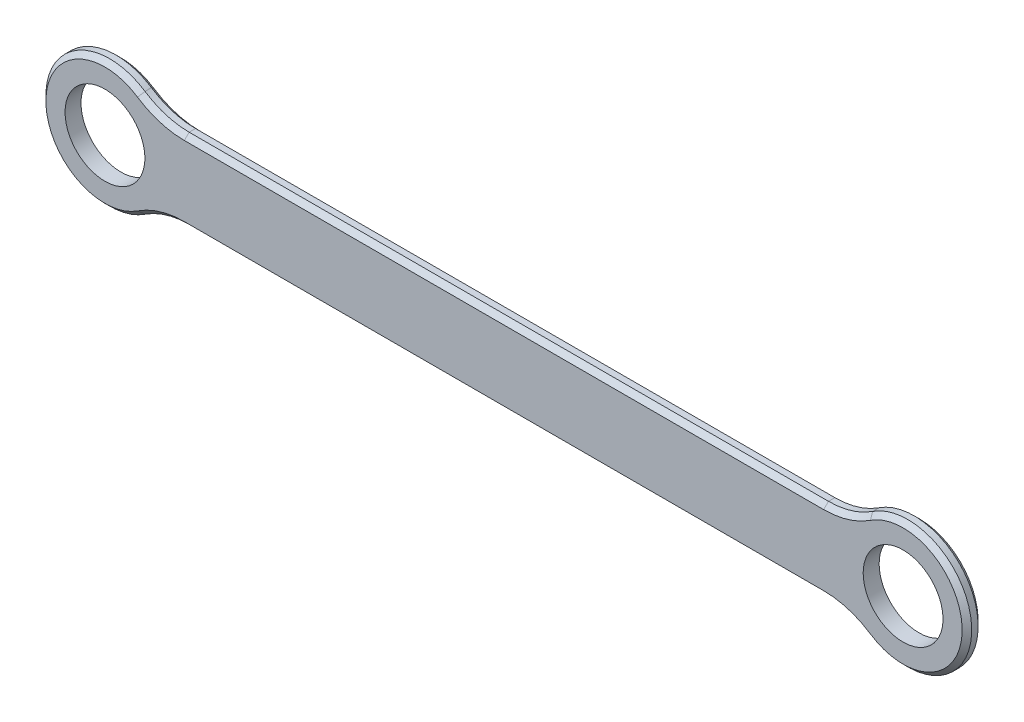
ISO-10303-21;
HEADER;
FILE_DESCRIPTION(('STEP AP214'),'2;1');
FILE_NAME('part.step','',(''),(''),'','','');
FILE_SCHEMA(('AUTOMOTIVE_DESIGN { 1 0 10303 214 1 1 1 1 }'));
ENDSEC;
DATA;
#1=APPLICATION_CONTEXT('core data for automotive mechanical design processes');
#2=APPLICATION_PROTOCOL_DEFINITION('international standard','automotive_design',2000,#1);
#3=PRODUCT_CONTEXT('',#1,'mechanical');
#4=PRODUCT('Part','Part','',(#3));
#5=PRODUCT_RELATED_PRODUCT_CATEGORY('part','',(#4));
#6=PRODUCT_DEFINITION_FORMATION('','',#4);
#7=PRODUCT_DEFINITION_CONTEXT('part definition',#1,'design');
#8=PRODUCT_DEFINITION('design','',#6,#7);
#9=PRODUCT_DEFINITION_SHAPE('','',#8);
#10=(LENGTH_UNIT() NAMED_UNIT(*) SI_UNIT(.MILLI.,.METRE.));
#11=(NAMED_UNIT(*) PLANE_ANGLE_UNIT() SI_UNIT($,.RADIAN.));
#12=(NAMED_UNIT(*) SI_UNIT($,.STERADIAN.) SOLID_ANGLE_UNIT());
#13=UNCERTAINTY_MEASURE_WITH_UNIT(LENGTH_MEASURE(1.E-05),#10,'distance_accuracy_value','');
#14=(GEOMETRIC_REPRESENTATION_CONTEXT(3) GLOBAL_UNCERTAINTY_ASSIGNED_CONTEXT((#13)) GLOBAL_UNIT_ASSIGNED_CONTEXT((#10,
#11,#12)) REPRESENTATION_CONTEXT('',''));
#15=CARTESIAN_POINT('',(0.,0.,0.));
#16=DIRECTION('',(0.,0.,1.));
#17=DIRECTION('',(1.,0.,0.));
#18=AXIS2_PLACEMENT_3D('',#15,#16,#17);
#19=CARTESIAN_POINT('',(0.,0.042307692307692,0.1));
#20=DIRECTION('',(0.,1.,0.));
#21=DIRECTION('',(0.,0.,1.));
#22=AXIS2_PLACEMENT_3D('',#19,#20,#21);
#23=PLANE('',#22);
#24=DIRECTION('',(0.,0.,-1.));
#25=VECTOR('',#24,1.);
#26=CARTESIAN_POINT('',(1.97686525580566,0.042307692307692,0.1));
#27=LINE('',#26,#25);
#28=CARTESIAN_POINT('',(1.97686525580566,0.042307692307692,0.070000000000001));
#29=VERTEX_POINT('',#28);
#30=CARTESIAN_POINT('',(1.97686525580566,0.042307692307692,0.0300000000000012));
#31=VERTEX_POINT('',#30);
#32=EDGE_CURVE('E274',#29,#31,#27,.T.);
#33=ORIENTED_EDGE('',*,*,#32,.T.);
#34=DIRECTION('',(-1.,0.,0.));
#35=VECTOR('',#34,1.);
#36=CARTESIAN_POINT('',(-2.02814730708772,0.042307692307692,0.0300000000000012));
#37=LINE('',#36,#35);
#38=CARTESIAN_POINT('',(-2.02814730708772,0.042307692307692,0.0300000000000012));
#39=VERTEX_POINT('',#38);
#40=EDGE_CURVE('E96',#31,#39,#37,.T.);
#41=ORIENTED_EDGE('',*,*,#40,.T.);
#42=DIRECTION('',(0.,0.,-1.));
#43=VECTOR('',#42,1.);
#44=CARTESIAN_POINT('',(-2.02814730708772,0.042307692307692,0.1));
#45=LINE('',#44,#43);
#46=CARTESIAN_POINT('',(-2.02814730708772,0.042307692307692,0.070000000000001));
#47=VERTEX_POINT('',#46);
#48=EDGE_CURVE('E378',#39,#47,#45,.F.);
#49=ORIENTED_EDGE('',*,*,#48,.T.);
#50=DIRECTION('',(1.,0.,0.));
#51=VECTOR('',#50,1.);
#52=CARTESIAN_POINT('',(0.,0.042307692307692,0.070000000000001));
#53=LINE('',#52,#51);
#54=EDGE_CURVE('E220',#47,#29,#53,.T.);
#55=ORIENTED_EDGE('',*,*,#54,.T.);
#56=EDGE_LOOP('',(#33,#41,#49,#55));
#57=FACE_BOUND('',#56,.T.);
#58=ADVANCED_FACE('F71',(#57),#23,.T.);
#59=CARTESIAN_POINT('',(0.,-0.457692307692308,0.1));
#60=DIRECTION('',(0.,1.,0.));
#61=DIRECTION('',(-1.,0.,0.));
#62=AXIS2_PLACEMENT_3D('',#59,#60,#61);
#63=PLANE('',#62);
#64=DIRECTION('',(0.,0.,1.));
#65=VECTOR('',#64,1.);
#66=CARTESIAN_POINT('',(-2.02814730708772,-0.457692307692308,0.));
#67=LINE('',#66,#65);
#68=CARTESIAN_POINT('',(-2.02814730708772,-0.457692307692308,0.070000000000001));
#69=VERTEX_POINT('',#68);
#70=CARTESIAN_POINT('',(-2.02814730708772,-0.457692307692308,0.0300000000000012));
#71=VERTEX_POINT('',#70);
#72=EDGE_CURVE('E384',#69,#71,#67,.F.);
#73=ORIENTED_EDGE('',*,*,#72,.T.);
#74=DIRECTION('',(1.,0.,0.));
#75=VECTOR('',#74,1.);
#76=CARTESIAN_POINT('',(0.,-0.457692307692308,0.0300000000000012));
#77=LINE('',#76,#75);
#78=CARTESIAN_POINT('',(1.97686525580566,-0.457692307692308,0.0300000000000012));
#79=VERTEX_POINT('',#78);
#80=EDGE_CURVE('E303',#71,#79,#77,.T.);
#81=ORIENTED_EDGE('',*,*,#80,.T.);
#82=DIRECTION('',(0.,0.,1.));
#83=VECTOR('',#82,1.);
#84=CARTESIAN_POINT('',(1.97686525580566,-0.457692307692308,0.1));
#85=LINE('',#84,#83);
#86=CARTESIAN_POINT('',(1.97686525580566,-0.457692307692308,0.070000000000001));
#87=VERTEX_POINT('',#86);
#88=EDGE_CURVE('E381',#79,#87,#85,.T.);
#89=ORIENTED_EDGE('',*,*,#88,.T.);
#90=DIRECTION('',(-1.,0.,0.));
#91=VECTOR('',#90,1.);
#92=CARTESIAN_POINT('',(-2.02814730708772,-0.457692307692308,0.070000000000001));
#93=LINE('',#92,#91);
#94=EDGE_CURVE('E239',#87,#69,#93,.T.);
#95=ORIENTED_EDGE('',*,*,#94,.T.);
#96=EDGE_LOOP('',(#73,#81,#89,#95));
#97=FACE_BOUND('',#96,.T.);
#98=ADVANCED_FACE('F435',(#97),#63,.F.);
#99=CARTESIAN_POINT('',(0.,0.,0.));
#100=DIRECTION('',(0.,0.,1.));
#101=DIRECTION('',(1.,0.,0.));
#102=AXIS2_PLACEMENT_3D('',#99,#100,#101);
#103=PLANE('',#102);
#104=CARTESIAN_POINT('',(2.47435897435897,-0.207692307692308,0.));
#105=DIRECTION('',(0.,0.,1.));
#106=DIRECTION('',(1.,0.,0.));
#107=AXIS2_PLACEMENT_3D('',#104,#105,#106);
#108=CIRCLE('',#107,0.25);
#109=CARTESIAN_POINT('',(2.72435897435897,-0.207692307692308,0.));
#110=VERTEX_POINT('',#109);
#111=EDGE_CURVE('E323',#110,#110,#108,.T.);
#112=ORIENTED_EDGE('',*,*,#111,.T.);
#113=EDGE_LOOP('',(#112));
#114=FACE_BOUND('',#113,.T.);
#115=CARTESIAN_POINT('',(-2.52564102564103,-0.207692307692308,0.));
#116=DIRECTION('',(0.,0.,1.));
#117=DIRECTION('',(1.,0.,0.));
#118=AXIS2_PLACEMENT_3D('',#115,#116,#117);
#119=CIRCLE('',#118,0.25);
#120=CARTESIAN_POINT('',(-2.27564102564103,-0.207692307692308,0.));
#121=VERTEX_POINT('',#120);
#122=EDGE_CURVE('E702',#121,#121,#119,.T.);
#123=ORIENTED_EDGE('',*,*,#122,.T.);
#124=EDGE_LOOP('',(#123));
#125=FACE_BOUND('',#124,.T.);
#126=DIRECTION('',(-1.,0.,0.));
#127=VECTOR('',#126,1.);
#128=CARTESIAN_POINT('',(0.,-0.427692307692306,0.));
#129=LINE('',#128,#127);
#130=CARTESIAN_POINT('',(1.97686525580566,-0.427692307692306,0.));
#131=VERTEX_POINT('',#130);
#132=CARTESIAN_POINT('',(-2.02814730708772,-0.427692307692306,0.));
#133=VERTEX_POINT('',#132);
#134=EDGE_CURVE('E292',#131,#133,#129,.T.);
#135=ORIENTED_EDGE('',*,*,#134,.T.);
#136=CARTESIAN_POINT('',(-2.02814730708772,-0.957692307692308,0.));
#137=DIRECTION('',(0.,0.,1.));
#138=DIRECTION('',(1.,0.,0.));
#139=AXIS2_PLACEMENT_3D('',#136,#137,#138);
#140=CIRCLE('',#139,0.530000000000002);
#141=CARTESIAN_POINT('',(-2.32111583023578,-0.51602564102564,0.));
#142=VERTEX_POINT('',#141);
#143=EDGE_CURVE('E295',#133,#142,#140,.T.);
#144=ORIENTED_EDGE('',*,*,#143,.T.);
#145=CARTESIAN_POINT('',(-2.52564102564103,-0.207692307692308,0.));
#146=DIRECTION('',(0.,0.,1.));
#147=DIRECTION('',(1.,0.,0.));
#148=AXIS2_PLACEMENT_3D('',#145,#146,#147);
#149=CIRCLE('',#148,0.369999999999998);
#150=CARTESIAN_POINT('',(-2.32111583023578,0.100641025641024,0.));
#151=VERTEX_POINT('',#150);
#152=EDGE_CURVE('E248',#142,#151,#149,.F.);
#153=ORIENTED_EDGE('',*,*,#152,.T.);
#154=CARTESIAN_POINT('',(-2.02814730708772,0.542307692307692,0.));
#155=DIRECTION('',(0.,0.,1.));
#156=DIRECTION('',(1.,0.,0.));
#157=AXIS2_PLACEMENT_3D('',#154,#155,#156);
#158=CIRCLE('',#157,0.530000000000002);
#159=CARTESIAN_POINT('',(-2.02814730708772,0.0123076923076902,0.));
#160=VERTEX_POINT('',#159);
#161=EDGE_CURVE('E277',#151,#160,#158,.T.);
#162=ORIENTED_EDGE('',*,*,#161,.T.);
#163=DIRECTION('',(1.,0.,0.));
#164=VECTOR('',#163,1.);
#165=CARTESIAN_POINT('',(1.97686525580566,0.0123076923076902,0.));
#166=LINE('',#165,#164);
#167=CARTESIAN_POINT('',(1.97686525580566,0.0123076923076902,0.));
#168=VERTEX_POINT('',#167);
#169=EDGE_CURVE('E280',#160,#168,#166,.T.);
#170=ORIENTED_EDGE('',*,*,#169,.T.);
#171=CARTESIAN_POINT('',(1.97686525580566,0.542307692307692,0.));
#172=DIRECTION('',(0.,0.,1.));
#173=DIRECTION('',(1.,0.,0.));
#174=AXIS2_PLACEMENT_3D('',#171,#172,#173);
#175=CIRCLE('',#174,0.530000000000002);
#176=CARTESIAN_POINT('',(2.26983377895372,0.100641025641024,0.));
#177=VERTEX_POINT('',#176);
#178=EDGE_CURVE('E283',#168,#177,#175,.T.);
#179=ORIENTED_EDGE('',*,*,#178,.T.);
#180=CARTESIAN_POINT('',(2.47435897435897,-0.207692307692308,0.));
#181=DIRECTION('',(0.,0.,1.));
#182=DIRECTION('',(1.,0.,0.));
#183=AXIS2_PLACEMENT_3D('',#180,#181,#182);
#184=CIRCLE('',#183,0.369999999999998);
#185=CARTESIAN_POINT('',(2.26983377895373,-0.51602564102564,0.));
#186=VERTEX_POINT('',#185);
#187=EDGE_CURVE('E286',#177,#186,#184,.F.);
#188=ORIENTED_EDGE('',*,*,#187,.T.);
#189=CARTESIAN_POINT('',(1.97686525580566,-0.957692307692308,0.));
#190=DIRECTION('',(0.,0.,1.));
#191=DIRECTION('',(1.,0.,0.));
#192=AXIS2_PLACEMENT_3D('',#189,#190,#191);
#193=CIRCLE('',#192,0.530000000000002);
#194=EDGE_CURVE('E289',#186,#131,#193,.T.);
#195=ORIENTED_EDGE('',*,*,#194,.T.);
#196=EDGE_LOOP('',(#135,#144,#153,#162,#170,#179,#188,#195));
#197=FACE_BOUND('',#196,.T.);
#198=ADVANCED_FACE('F467',(#114,#125,#197),#103,.F.);
#199=CARTESIAN_POINT('',(0.,0.,0.1));
#200=DIRECTION('',(0.,0.,1.));
#201=DIRECTION('',(1.,0.,0.));
#202=AXIS2_PLACEMENT_3D('',#199,#200,#201);
#203=PLANE('',#202);
#204=CARTESIAN_POINT('',(2.47435897435897,-0.207692307692308,0.1));
#205=DIRECTION('',(0.,0.,-1.));
#206=DIRECTION('',(-1.,0.,0.));
#207=AXIS2_PLACEMENT_3D('',#204,#205,#206);
#208=CIRCLE('',#207,0.25);
#209=CARTESIAN_POINT('',(2.22435897435897,-0.207692307692308,0.1));
#210=VERTEX_POINT('',#209);
#211=EDGE_CURVE('E705',#210,#210,#208,.T.);
#212=ORIENTED_EDGE('',*,*,#211,.T.);
#213=EDGE_LOOP('',(#212));
#214=FACE_BOUND('',#213,.T.);
#215=CARTESIAN_POINT('',(-2.52564102564103,-0.207692307692308,0.1));
#216=DIRECTION('',(0.,0.,-1.));
#217=DIRECTION('',(-1.,0.,0.));
#218=AXIS2_PLACEMENT_3D('',#215,#216,#217);
#219=CIRCLE('',#218,0.25);
#220=CARTESIAN_POINT('',(-2.77564102564103,-0.207692307692308,0.1));
#221=VERTEX_POINT('',#220);
#222=EDGE_CURVE('E709',#221,#221,#219,.T.);
#223=ORIENTED_EDGE('',*,*,#222,.T.);
#224=EDGE_LOOP('',(#223));
#225=FACE_BOUND('',#224,.T.);
#226=DIRECTION('',(-1.,0.,0.));
#227=VECTOR('',#226,1.);
#228=CARTESIAN_POINT('',(0.,0.0123076923076932,0.1));
#229=LINE('',#228,#227);
#230=CARTESIAN_POINT('',(1.97686525580566,0.0123076923076931,0.1));
#231=VERTEX_POINT('',#230);
#232=CARTESIAN_POINT('',(-2.02814730708772,0.0123076923076932,0.1));
#233=VERTEX_POINT('',#232);
#234=EDGE_CURVE('E214',#231,#233,#229,.T.);
#235=ORIENTED_EDGE('',*,*,#234,.T.);
#236=CARTESIAN_POINT('',(-2.02814730708772,0.542307692307692,0.1));
#237=DIRECTION('',(0.,0.,1.));
#238=DIRECTION('',(1.,0.,0.));
#239=AXIS2_PLACEMENT_3D('',#236,#237,#238);
#240=CIRCLE('',#239,0.529999999999999);
#241=CARTESIAN_POINT('',(-2.32111583023578,0.100641025641026,0.1));
#242=VERTEX_POINT('',#241);
#243=EDGE_CURVE('E193',#233,#242,#240,.F.);
#244=ORIENTED_EDGE('',*,*,#243,.T.);
#245=CARTESIAN_POINT('',(-2.52564102564103,-0.207692307692308,0.1));
#246=DIRECTION('',(0.,0.,1.));
#247=DIRECTION('',(1.,0.,0.));
#248=AXIS2_PLACEMENT_3D('',#245,#246,#247);
#249=CIRCLE('',#248,0.370000000000001);
#250=CARTESIAN_POINT('',(-2.32111583023578,-0.516025641025642,0.1));
#251=VERTEX_POINT('',#250);
#252=EDGE_CURVE('E202',#242,#251,#249,.T.);
#253=ORIENTED_EDGE('',*,*,#252,.T.);
#254=CARTESIAN_POINT('',(-2.02814730708772,-0.957692307692308,0.1));
#255=DIRECTION('',(0.,0.,1.));
#256=DIRECTION('',(1.,0.,0.));
#257=AXIS2_PLACEMENT_3D('',#254,#255,#256);
#258=CIRCLE('',#257,0.529999999999999);
#259=CARTESIAN_POINT('',(-2.02814730708772,-0.427692307692309,0.1));
#260=VERTEX_POINT('',#259);
#261=EDGE_CURVE('E209',#251,#260,#258,.F.);
#262=ORIENTED_EDGE('',*,*,#261,.T.);
#263=DIRECTION('',(1.,0.,0.));
#264=VECTOR('',#263,1.);
#265=CARTESIAN_POINT('',(1.97686525580566,-0.427692307692309,0.1));
#266=LINE('',#265,#264);
#267=CARTESIAN_POINT('',(1.97686525580566,-0.427692307692309,0.1));
#268=VERTEX_POINT('',#267);
#269=EDGE_CURVE('E393',#260,#268,#266,.T.);
#270=ORIENTED_EDGE('',*,*,#269,.T.);
#271=CARTESIAN_POINT('',(1.97686525580566,-0.957692307692308,0.1));
#272=DIRECTION('',(0.,0.,1.));
#273=DIRECTION('',(1.,0.,0.));
#274=AXIS2_PLACEMENT_3D('',#271,#272,#273);
#275=CIRCLE('',#274,0.529999999999999);
#276=CARTESIAN_POINT('',(2.26983377895372,-0.516025641025642,0.1));
#277=VERTEX_POINT('',#276);
#278=EDGE_CURVE('E396',#268,#277,#275,.F.);
#279=ORIENTED_EDGE('',*,*,#278,.T.);
#280=CARTESIAN_POINT('',(2.47435897435897,-0.207692307692308,0.1));
#281=DIRECTION('',(0.,0.,1.));
#282=DIRECTION('',(1.,0.,0.));
#283=AXIS2_PLACEMENT_3D('',#280,#281,#282);
#284=CIRCLE('',#283,0.370000000000001);
#285=CARTESIAN_POINT('',(2.26983377895372,0.100641025641027,0.1));
#286=VERTEX_POINT('',#285);
#287=EDGE_CURVE('E399',#277,#286,#284,.T.);
#288=ORIENTED_EDGE('',*,*,#287,.T.);
#289=CARTESIAN_POINT('',(1.97686525580566,0.542307692307692,0.1));
#290=DIRECTION('',(0.,0.,1.));
#291=DIRECTION('',(1.,0.,0.));
#292=AXIS2_PLACEMENT_3D('',#289,#290,#291);
#293=CIRCLE('',#292,0.529999999999999);
#294=EDGE_CURVE('E222',#286,#231,#293,.F.);
#295=ORIENTED_EDGE('',*,*,#294,.T.);
#296=EDGE_LOOP('',(#235,#244,#253,#262,#270,#279,#288,#295));
#297=FACE_BOUND('',#296,.T.);
#298=ADVANCED_FACE('F212',(#214,#225,#297),#203,.T.);
#299=CARTESIAN_POINT('',(2.47435897435897,-0.207692307692308,0.1));
#300=DIRECTION('',(0.,0.,-1.));
#301=DIRECTION('',(-1.,0.,0.));
#302=AXIS2_PLACEMENT_3D('',#299,#300,#301);
#303=CYLINDRICAL_SURFACE('',#302,0.4);
#304=DIRECTION('',(0.,0.,-1.));
#305=VECTOR('',#304,1.);
#306=CARTESIAN_POINT('',(2.25325065500195,-0.541025641025642,0.1));
#307=LINE('',#306,#305);
#308=CARTESIAN_POINT('',(2.25325065500195,-0.541025641025642,0.070000000000001));
#309=VERTEX_POINT('',#308);
#310=CARTESIAN_POINT('',(2.25325065500195,-0.541025641025642,0.0300000000000012));
#311=VERTEX_POINT('',#310);
#312=EDGE_CURVE('E210',#309,#311,#307,.T.);
#313=ORIENTED_EDGE('',*,*,#312,.T.);
#314=CARTESIAN_POINT('',(2.47435897435897,-0.207692307692308,0.0300000000000012));
#315=DIRECTION('',(0.,0.,1.));
#316=DIRECTION('',(1.,0.,0.));
#317=AXIS2_PLACEMENT_3D('',#314,#315,#316);
#318=CIRCLE('',#317,0.4);
#319=CARTESIAN_POINT('',(2.25325065500195,0.125641025641025,0.0300000000000012));
#320=VERTEX_POINT('',#319);
#321=EDGE_CURVE('E309',#311,#320,#318,.T.);
#322=ORIENTED_EDGE('',*,*,#321,.T.);
#323=DIRECTION('',(0.,0.,-1.));
#324=VECTOR('',#323,1.);
#325=CARTESIAN_POINT('',(2.25325065500195,0.125641025641025,0.1));
#326=LINE('',#325,#324);
#327=CARTESIAN_POINT('',(2.25325065500195,0.125641025641025,0.070000000000001));
#328=VERTEX_POINT('',#327);
#329=EDGE_CURVE('E363',#320,#328,#326,.F.);
#330=ORIENTED_EDGE('',*,*,#329,.T.);
#331=CARTESIAN_POINT('',(2.47435897435897,-0.207692307692308,0.070000000000001));
#332=DIRECTION('',(0.,0.,1.));
#333=DIRECTION('',(1.,0.,0.));
#334=AXIS2_PLACEMENT_3D('',#331,#332,#333);
#335=CIRCLE('',#334,0.4);
#336=EDGE_CURVE('E232',#328,#309,#335,.F.);
#337=ORIENTED_EDGE('',*,*,#336,.T.);
#338=EDGE_LOOP('',(#313,#322,#330,#337));
#339=FACE_BOUND('',#338,.T.);
#340=ADVANCED_FACE('F455',(#339),#303,.T.);
#341=CARTESIAN_POINT('',(-2.52564102564103,-0.207692307692308,0.1));
#342=DIRECTION('',(0.,0.,-1.));
#343=DIRECTION('',(-1.,0.,0.));
#344=AXIS2_PLACEMENT_3D('',#341,#342,#343);
#345=CYLINDRICAL_SURFACE('',#344,0.4);
#346=DIRECTION('',(0.,0.,-1.));
#347=VECTOR('',#346,1.);
#348=CARTESIAN_POINT('',(-2.304532706284,0.125641025641025,0.1));
#349=LINE('',#348,#347);
#350=CARTESIAN_POINT('',(-2.304532706284,0.125641025641025,0.070000000000001));
#351=VERTEX_POINT('',#350);
#352=CARTESIAN_POINT('',(-2.304532706284,0.125641025641025,0.0300000000000012));
#353=VERTEX_POINT('',#352);
#354=EDGE_CURVE('E375',#351,#353,#349,.T.);
#355=ORIENTED_EDGE('',*,*,#354,.T.);
#356=CARTESIAN_POINT('',(-2.52564102564103,-0.207692307692308,0.0300000000000012));
#357=DIRECTION('',(0.,0.,1.));
#358=DIRECTION('',(1.,0.,0.));
#359=AXIS2_PLACEMENT_3D('',#356,#357,#358);
#360=CIRCLE('',#359,0.4);
#361=CARTESIAN_POINT('',(-2.304532706284,-0.541025641025641,0.0300000000000012));
#362=VERTEX_POINT('',#361);
#363=EDGE_CURVE('E12',#353,#362,#360,.T.);
#364=ORIENTED_EDGE('',*,*,#363,.T.);
#365=DIRECTION('',(0.,0.,-1.));
#366=VECTOR('',#365,1.);
#367=CARTESIAN_POINT('',(-2.304532706284,-0.541025641025641,0.1));
#368=LINE('',#367,#366);
#369=CARTESIAN_POINT('',(-2.304532706284,-0.541025641025641,0.070000000000001));
#370=VERTEX_POINT('',#369);
#371=EDGE_CURVE('E368',#362,#370,#368,.F.);
#372=ORIENTED_EDGE('',*,*,#371,.T.);
#373=CARTESIAN_POINT('',(-2.52564102564103,-0.207692307692308,0.070000000000001));
#374=DIRECTION('',(0.,0.,1.));
#375=DIRECTION('',(1.,0.,0.));
#376=AXIS2_PLACEMENT_3D('',#373,#374,#375);
#377=CIRCLE('',#376,0.4);
#378=EDGE_CURVE('E246',#370,#351,#377,.F.);
#379=ORIENTED_EDGE('',*,*,#378,.T.);
#380=EDGE_LOOP('',(#355,#364,#372,#379));
#381=FACE_BOUND('',#380,.T.);
#382=ADVANCED_FACE('F414',(#381),#345,.T.);
#383=CARTESIAN_POINT('',(1.97686525580566,0.542307692307692,0.1));
#384=DIRECTION('',(0.,0.,-1.));
#385=DIRECTION('',(-1.,0.,0.));
#386=AXIS2_PLACEMENT_3D('',#383,#384,#385);
#387=CYLINDRICAL_SURFACE('',#386,0.5);
#388=ORIENTED_EDGE('',*,*,#329,.F.);
#389=CARTESIAN_POINT('',(1.97686525580566,0.542307692307692,0.0300000000000012));
#390=DIRECTION('',(0.,0.,1.));
#391=DIRECTION('',(1.,0.,0.));
#392=AXIS2_PLACEMENT_3D('',#389,#390,#391);
#393=CIRCLE('',#392,0.5);
#394=EDGE_CURVE('E312',#320,#31,#393,.F.);
#395=ORIENTED_EDGE('',*,*,#394,.T.);
#396=ORIENTED_EDGE('',*,*,#32,.F.);
#397=CARTESIAN_POINT('',(1.97686525580566,0.542307692307692,0.070000000000001));
#398=DIRECTION('',(0.,0.,1.));
#399=DIRECTION('',(1.,0.,0.));
#400=AXIS2_PLACEMENT_3D('',#397,#398,#399);
#401=CIRCLE('',#400,0.5);
#402=EDGE_CURVE('E228',#29,#328,#401,.T.);
#403=ORIENTED_EDGE('',*,*,#402,.T.);
#404=EDGE_LOOP('',(#388,#395,#396,#403));
#405=FACE_BOUND('',#404,.T.);
#406=ADVANCED_FACE('F361',(#405),#387,.F.);
#407=CARTESIAN_POINT('',(-2.02814730708772,0.542307692307692,0.1));
#408=DIRECTION('',(0.,0.,-1.));
#409=DIRECTION('',(-1.,0.,0.));
#410=AXIS2_PLACEMENT_3D('',#407,#408,#409);
#411=CYLINDRICAL_SURFACE('',#410,0.5);
#412=ORIENTED_EDGE('',*,*,#48,.F.);
#413=CARTESIAN_POINT('',(-2.02814730708772,0.542307692307692,0.0300000000000012));
#414=DIRECTION('',(0.,0.,1.));
#415=DIRECTION('',(1.,0.,0.));
#416=AXIS2_PLACEMENT_3D('',#413,#414,#415);
#417=CIRCLE('',#416,0.5);
#418=EDGE_CURVE('E81',#39,#353,#417,.F.);
#419=ORIENTED_EDGE('',*,*,#418,.T.);
#420=ORIENTED_EDGE('',*,*,#354,.F.);
#421=CARTESIAN_POINT('',(-2.02814730708772,0.542307692307692,0.070000000000001));
#422=DIRECTION('',(0.,0.,1.));
#423=DIRECTION('',(1.,0.,0.));
#424=AXIS2_PLACEMENT_3D('',#421,#422,#423);
#425=CIRCLE('',#424,0.5);
#426=EDGE_CURVE('E195',#351,#47,#425,.T.);
#427=ORIENTED_EDGE('',*,*,#426,.T.);
#428=EDGE_LOOP('',(#412,#419,#420,#427));
#429=FACE_BOUND('',#428,.T.);
#430=ADVANCED_FACE('F410',(#429),#411,.F.);
#431=CARTESIAN_POINT('',(-2.02814730708772,-0.957692307692308,0.1));
#432=DIRECTION('',(0.,0.,-1.));
#433=DIRECTION('',(-1.,0.,0.));
#434=AXIS2_PLACEMENT_3D('',#431,#432,#433);
#435=CYLINDRICAL_SURFACE('',#434,0.5);
#436=ORIENTED_EDGE('',*,*,#371,.F.);
#437=CARTESIAN_POINT('',(-2.02814730708772,-0.957692307692308,0.0300000000000012));
#438=DIRECTION('',(0.,0.,1.));
#439=DIRECTION('',(1.,0.,0.));
#440=AXIS2_PLACEMENT_3D('',#437,#438,#439);
#441=CIRCLE('',#440,0.5);
#442=EDGE_CURVE('E299',#362,#71,#441,.F.);
#443=ORIENTED_EDGE('',*,*,#442,.T.);
#444=ORIENTED_EDGE('',*,*,#72,.F.);
#445=CARTESIAN_POINT('',(-2.02814730708772,-0.957692307692308,0.070000000000001));
#446=DIRECTION('',(0.,0.,1.));
#447=DIRECTION('',(1.,0.,0.));
#448=AXIS2_PLACEMENT_3D('',#445,#446,#447);
#449=CIRCLE('',#448,0.5);
#450=EDGE_CURVE('E242',#69,#370,#449,.T.);
#451=ORIENTED_EDGE('',*,*,#450,.T.);
#452=EDGE_LOOP('',(#436,#443,#444,#451));
#453=FACE_BOUND('',#452,.T.);
#454=ADVANCED_FACE('F432',(#453),#435,.F.);
#455=CARTESIAN_POINT('',(1.97686525580566,-0.957692307692308,0.1));
#456=DIRECTION('',(0.,0.,-1.));
#457=DIRECTION('',(-1.,0.,0.));
#458=AXIS2_PLACEMENT_3D('',#455,#456,#457);
#459=CYLINDRICAL_SURFACE('',#458,0.5);
#460=ORIENTED_EDGE('',*,*,#88,.F.);
#461=CARTESIAN_POINT('',(1.97686525580566,-0.957692307692308,0.0300000000000012));
#462=DIRECTION('',(0.,0.,1.));
#463=DIRECTION('',(1.,0.,0.));
#464=AXIS2_PLACEMENT_3D('',#461,#462,#463);
#465=CIRCLE('',#464,0.5);
#466=EDGE_CURVE('E306',#79,#311,#465,.F.);
#467=ORIENTED_EDGE('',*,*,#466,.T.);
#468=ORIENTED_EDGE('',*,*,#312,.F.);
#469=CARTESIAN_POINT('',(1.97686525580566,-0.957692307692308,0.070000000000001));
#470=DIRECTION('',(0.,0.,1.));
#471=DIRECTION('',(1.,0.,0.));
#472=AXIS2_PLACEMENT_3D('',#469,#470,#471);
#473=CIRCLE('',#472,0.5);
#474=EDGE_CURVE('E235',#309,#87,#473,.T.);
#475=ORIENTED_EDGE('',*,*,#474,.T.);
#476=EDGE_LOOP('',(#460,#467,#468,#475));
#477=FACE_BOUND('',#476,.T.);
#478=ADVANCED_FACE('F457',(#477),#459,.F.);
#479=CARTESIAN_POINT('',(1.97686525580566,-0.957692307692308,0.1));
#480=DIRECTION('',(0.,0.,1.));
#481=DIRECTION('',(1.,0.,0.));
#482=AXIS2_PLACEMENT_3D('',#479,#480,#481);
#483=CONICAL_SURFACE('',#482,0.529999999999999,0.785398163397445);
#484=DIRECTION('',(0.,0.707106781186545,0.70710678118655));
#485=VECTOR('',#484,1.);
#486=CARTESIAN_POINT('',(1.97686525580566,-0.457692307692308,0.070000000000001));
#487=LINE('',#486,#485);
#488=EDGE_CURVE('E266',#87,#268,#487,.T.);
#489=ORIENTED_EDGE('',*,*,#488,.F.);
#490=ORIENTED_EDGE('',*,*,#474,.F.);
#491=DIRECTION('',(-0.390867979985288,-0.589255650988785,-0.70710678118655));
#492=VECTOR('',#491,1.);
#493=CARTESIAN_POINT('',(2.26983377895372,-0.516025641025642,0.1));
#494=LINE('',#493,#492);
#495=EDGE_CURVE('E270',#277,#309,#494,.T.);
#496=ORIENTED_EDGE('',*,*,#495,.F.);
#497=ORIENTED_EDGE('',*,*,#278,.F.);
#498=EDGE_LOOP('',(#489,#490,#496,#497));
#499=FACE_BOUND('',#498,.T.);
#500=ADVANCED_FACE('F448',(#499),#483,.F.);
#501=CARTESIAN_POINT('',(2.47435897435897,-0.207692307692308,0.1));
#502=DIRECTION('',(0.,0.,-1.));
#503=DIRECTION('',(-1.,0.,0.));
#504=AXIS2_PLACEMENT_3D('',#501,#502,#503);
#505=CONICAL_SURFACE('',#504,0.370000000000001,0.785398163397445);
#506=ORIENTED_EDGE('',*,*,#495,.T.);
#507=ORIENTED_EDGE('',*,*,#336,.F.);
#508=DIRECTION('',(-0.390867979985288,0.589255650988785,-0.70710678118655));
#509=VECTOR('',#508,1.);
#510=CARTESIAN_POINT('',(2.26983377895372,0.100641025641027,0.1));
#511=LINE('',#510,#509);
#512=EDGE_CURVE('E262',#286,#328,#511,.T.);
#513=ORIENTED_EDGE('',*,*,#512,.F.);
#514=ORIENTED_EDGE('',*,*,#287,.F.);
#515=EDGE_LOOP('',(#506,#507,#513,#514));
#516=FACE_BOUND('',#515,.T.);
#517=ADVANCED_FACE('F452',(#516),#505,.T.);
#518=CARTESIAN_POINT('',(0.,-0.427692307692309,0.1));
#519=DIRECTION('',(0.,-0.70710678118655,0.707106781186545));
#520=DIRECTION('',(-1.,0.,0.));
#521=AXIS2_PLACEMENT_3D('',#518,#519,#520);
#522=PLANE('',#521);
#523=ORIENTED_EDGE('',*,*,#488,.T.);
#524=ORIENTED_EDGE('',*,*,#269,.F.);
#525=DIRECTION('',(0.,0.707106781186545,0.70710678118655));
#526=VECTOR('',#525,1.);
#527=CARTESIAN_POINT('',(-2.02814730708772,-0.457692307692308,0.070000000000001));
#528=LINE('',#527,#526);
#529=EDGE_CURVE('E258',#69,#260,#528,.T.);
#530=ORIENTED_EDGE('',*,*,#529,.F.);
#531=ORIENTED_EDGE('',*,*,#94,.F.);
#532=EDGE_LOOP('',(#523,#524,#530,#531));
#533=FACE_BOUND('',#532,.T.);
#534=ADVANCED_FACE('F439',(#533),#522,.T.);
#535=CARTESIAN_POINT('',(1.97686525580566,0.542307692307692,0.1));
#536=DIRECTION('',(0.,0.,1.));
#537=DIRECTION('',(1.,0.,0.));
#538=AXIS2_PLACEMENT_3D('',#535,#536,#537);
#539=CONICAL_SURFACE('',#538,0.529999999999999,0.785398163397445);
#540=ORIENTED_EDGE('',*,*,#512,.T.);
#541=ORIENTED_EDGE('',*,*,#402,.F.);
#542=DIRECTION('',(0.,0.707106781186546,-0.707106781186549));
#543=VECTOR('',#542,1.);
#544=CARTESIAN_POINT('',(1.97686525580566,0.0123076923076931,0.1));
#545=LINE('',#544,#543);
#546=EDGE_CURVE('E254',#231,#29,#545,.T.);
#547=ORIENTED_EDGE('',*,*,#546,.F.);
#548=ORIENTED_EDGE('',*,*,#294,.F.);
#549=EDGE_LOOP('',(#540,#541,#547,#548));
#550=FACE_BOUND('',#549,.T.);
#551=ADVANCED_FACE('F407',(#550),#539,.F.);
#552=CARTESIAN_POINT('',(-2.02814730708772,-0.957692307692308,0.1));
#553=DIRECTION('',(0.,0.,1.));
#554=DIRECTION('',(1.,0.,0.));
#555=AXIS2_PLACEMENT_3D('',#552,#553,#554);
#556=CONICAL_SURFACE('',#555,0.529999999999999,0.785398163397445);
#557=ORIENTED_EDGE('',*,*,#529,.T.);
#558=ORIENTED_EDGE('',*,*,#261,.F.);
#559=DIRECTION('',(-0.390867979985288,0.589255650988787,0.707106781186549));
#560=VECTOR('',#559,1.);
#561=CARTESIAN_POINT('',(-2.304532706284,-0.541025641025641,0.070000000000001));
#562=LINE('',#561,#560);
#563=EDGE_CURVE('E205',#370,#251,#562,.T.);
#564=ORIENTED_EDGE('',*,*,#563,.F.);
#565=ORIENTED_EDGE('',*,*,#450,.F.);
#566=EDGE_LOOP('',(#557,#558,#564,#565));
#567=FACE_BOUND('',#566,.T.);
#568=ADVANCED_FACE('F444',(#567),#556,.F.);
#569=CARTESIAN_POINT('',(0.,0.042307692307692,0.070000000000001));
#570=DIRECTION('',(0.,-0.70710678118655,-0.707106781186545));
#571=DIRECTION('',(1.,0.,0.));
#572=AXIS2_PLACEMENT_3D('',#569,#570,#571);
#573=PLANE('',#572);
#574=ORIENTED_EDGE('',*,*,#546,.T.);
#575=ORIENTED_EDGE('',*,*,#54,.F.);
#576=DIRECTION('',(0.,0.707106781186545,-0.70710678118655));
#577=VECTOR('',#576,1.);
#578=CARTESIAN_POINT('',(-2.02814730708772,0.0123076923076932,0.1));
#579=LINE('',#578,#577);
#580=EDGE_CURVE('E199',#233,#47,#579,.T.);
#581=ORIENTED_EDGE('',*,*,#580,.F.);
#582=ORIENTED_EDGE('',*,*,#234,.F.);
#583=EDGE_LOOP('',(#574,#575,#581,#582));
#584=FACE_BOUND('',#583,.T.);
#585=ADVANCED_FACE('F409',(#584),#573,.F.);
#586=CARTESIAN_POINT('',(-2.52564102564103,-0.207692307692308,0.1));
#587=DIRECTION('',(0.,0.,-1.));
#588=DIRECTION('',(-1.,0.,0.));
#589=AXIS2_PLACEMENT_3D('',#586,#587,#588);
#590=CONICAL_SURFACE('',#589,0.370000000000001,0.785398163397446);
#591=ORIENTED_EDGE('',*,*,#563,.T.);
#592=ORIENTED_EDGE('',*,*,#252,.F.);
#593=DIRECTION('',(-0.390867979985288,-0.589255650988785,0.70710678118655));
#594=VECTOR('',#593,1.);
#595=CARTESIAN_POINT('',(-2.304532706284,0.125641025641025,0.070000000000001));
#596=LINE('',#595,#594);
#597=EDGE_CURVE('E188',#351,#242,#596,.T.);
#598=ORIENTED_EDGE('',*,*,#597,.F.);
#599=ORIENTED_EDGE('',*,*,#378,.F.);
#600=EDGE_LOOP('',(#591,#592,#598,#599));
#601=FACE_BOUND('',#600,.T.);
#602=ADVANCED_FACE('F203',(#601),#590,.T.);
#603=CARTESIAN_POINT('',(-2.02814730708772,0.542307692307692,0.1));
#604=DIRECTION('',(0.,0.,1.));
#605=DIRECTION('',(1.,0.,0.));
#606=AXIS2_PLACEMENT_3D('',#603,#604,#605);
#607=CONICAL_SURFACE('',#606,0.529999999999999,0.785398163397445);
#608=ORIENTED_EDGE('',*,*,#580,.T.);
#609=ORIENTED_EDGE('',*,*,#426,.F.);
#610=ORIENTED_EDGE('',*,*,#597,.T.);
#611=ORIENTED_EDGE('',*,*,#243,.F.);
#612=EDGE_LOOP('',(#608,#609,#610,#611));
#613=FACE_BOUND('',#612,.T.);
#614=ADVANCED_FACE('F191',(#613),#607,.F.);
#615=CARTESIAN_POINT('',(1.97686525580566,0.542307692307692,0.));
#616=DIRECTION('',(0.,0.,-1.));
#617=DIRECTION('',(-1.,0.,0.));
#618=AXIS2_PLACEMENT_3D('',#615,#616,#617);
#619=CONICAL_SURFACE('',#618,0.530000000000002,0.785398163397459);
#620=DIRECTION('',(0.,-0.707106781186555,-0.70710678118654));
#621=VECTOR('',#620,1.);
#622=CARTESIAN_POINT('',(1.97686525580566,0.042307692307692,0.0300000000000012));
#623=LINE('',#622,#621);
#624=EDGE_CURVE('E341',#31,#168,#623,.T.);
#625=ORIENTED_EDGE('',*,*,#624,.F.);
#626=ORIENTED_EDGE('',*,*,#394,.F.);
#627=DIRECTION('',(-0.390867979985286,0.589255650988797,0.707106781186541));
#628=VECTOR('',#627,1.);
#629=CARTESIAN_POINT('',(2.26983377895372,0.100641025641024,0.));
#630=LINE('',#629,#628);
#631=EDGE_CURVE('E75',#177,#320,#630,.T.);
#632=ORIENTED_EDGE('',*,*,#631,.F.);
#633=ORIENTED_EDGE('',*,*,#178,.F.);
#634=EDGE_LOOP('',(#625,#626,#632,#633));
#635=FACE_BOUND('',#634,.T.);
#636=ADVANCED_FACE('F73',(#635),#619,.F.);
#637=CARTESIAN_POINT('',(2.47435897435897,-0.207692307692308,0.0300000000000012));
#638=DIRECTION('',(0.,0.,1.));
#639=DIRECTION('',(1.,0.,0.));
#640=AXIS2_PLACEMENT_3D('',#637,#638,#639);
#641=CONICAL_SURFACE('',#640,0.4,0.785398163397459);
#642=ORIENTED_EDGE('',*,*,#631,.T.);
#643=ORIENTED_EDGE('',*,*,#321,.F.);
#644=DIRECTION('',(-0.390867979985286,-0.589255650988798,0.707106781186541));
#645=VECTOR('',#644,1.);
#646=CARTESIAN_POINT('',(2.26983377895373,-0.51602564102564,0.));
#647=LINE('',#646,#645);
#648=EDGE_CURVE('E338',#186,#311,#647,.T.);
#649=ORIENTED_EDGE('',*,*,#648,.F.);
#650=ORIENTED_EDGE('',*,*,#187,.F.);
#651=EDGE_LOOP('',(#642,#643,#649,#650));
#652=FACE_BOUND('',#651,.T.);
#653=ADVANCED_FACE('F353',(#652),#641,.T.);
#654=CARTESIAN_POINT('',(0.,0.0123076923076902,0.));
#655=DIRECTION('',(0.,0.70710678118654,-0.707106781186555));
#656=DIRECTION('',(-1.,0.,0.));
#657=AXIS2_PLACEMENT_3D('',#654,#655,#656);
#658=PLANE('',#657);
#659=ORIENTED_EDGE('',*,*,#624,.T.);
#660=ORIENTED_EDGE('',*,*,#169,.F.);
#661=DIRECTION('',(0.,-0.707106781186555,-0.70710678118654));
#662=VECTOR('',#661,1.);
#663=CARTESIAN_POINT('',(-2.02814730708772,0.042307692307692,0.0300000000000012));
#664=LINE('',#663,#662);
#665=EDGE_CURVE('E334',#39,#160,#664,.T.);
#666=ORIENTED_EDGE('',*,*,#665,.F.);
#667=ORIENTED_EDGE('',*,*,#40,.F.);
#668=EDGE_LOOP('',(#659,#660,#666,#667));
#669=FACE_BOUND('',#668,.T.);
#670=ADVANCED_FACE('F468',(#669),#658,.T.);
#671=CARTESIAN_POINT('',(1.97686525580566,-0.957692307692308,0.));
#672=DIRECTION('',(0.,0.,-1.));
#673=DIRECTION('',(-1.,0.,0.));
#674=AXIS2_PLACEMENT_3D('',#671,#672,#673);
#675=CONICAL_SURFACE('',#674,0.530000000000002,0.785398163397459);
#676=ORIENTED_EDGE('',*,*,#648,.T.);
#677=ORIENTED_EDGE('',*,*,#466,.F.);
#678=DIRECTION('',(0.,-0.707106781186555,0.70710678118654));
#679=VECTOR('',#678,1.);
#680=CARTESIAN_POINT('',(1.97686525580566,-0.427692307692306,0.));
#681=LINE('',#680,#679);
#682=EDGE_CURVE('E330',#131,#79,#681,.T.);
#683=ORIENTED_EDGE('',*,*,#682,.F.);
#684=ORIENTED_EDGE('',*,*,#194,.F.);
#685=EDGE_LOOP('',(#676,#677,#683,#684));
#686=FACE_BOUND('',#685,.T.);
#687=ADVANCED_FACE('F461',(#686),#675,.F.);
#688=CARTESIAN_POINT('',(-2.02814730708772,0.542307692307692,0.));
#689=DIRECTION('',(0.,0.,-1.));
#690=DIRECTION('',(-1.,0.,0.));
#691=AXIS2_PLACEMENT_3D('',#688,#689,#690);
#692=CONICAL_SURFACE('',#691,0.530000000000002,0.785398163397457);
#693=ORIENTED_EDGE('',*,*,#665,.T.);
#694=ORIENTED_EDGE('',*,*,#161,.F.);
#695=DIRECTION('',(-0.390867979985286,-0.589255650988796,-0.707106781186542));
#696=VECTOR('',#695,1.);
#697=CARTESIAN_POINT('',(-2.304532706284,0.125641025641025,0.0300000000000012));
#698=LINE('',#697,#696);
#699=EDGE_CURVE('E326',#353,#151,#698,.T.);
#700=ORIENTED_EDGE('',*,*,#699,.F.);
#701=ORIENTED_EDGE('',*,*,#418,.F.);
#702=EDGE_LOOP('',(#693,#694,#700,#701));
#703=FACE_BOUND('',#702,.T.);
#704=ADVANCED_FACE('F419',(#703),#692,.F.);
#705=CARTESIAN_POINT('',(0.,-0.457692307692308,0.0300000000000012));
#706=DIRECTION('',(0.,0.70710678118654,0.707106781186555));
#707=DIRECTION('',(1.,0.,0.));
#708=AXIS2_PLACEMENT_3D('',#705,#706,#707);
#709=PLANE('',#708);
#710=ORIENTED_EDGE('',*,*,#682,.T.);
#711=ORIENTED_EDGE('',*,*,#80,.F.);
#712=DIRECTION('',(0.,-0.707106781186555,0.70710678118654));
#713=VECTOR('',#712,1.);
#714=CARTESIAN_POINT('',(-2.02814730708772,-0.427692307692306,0.));
#715=LINE('',#714,#713);
#716=EDGE_CURVE('E322',#133,#71,#715,.T.);
#717=ORIENTED_EDGE('',*,*,#716,.F.);
#718=ORIENTED_EDGE('',*,*,#134,.F.);
#719=EDGE_LOOP('',(#710,#711,#717,#718));
#720=FACE_BOUND('',#719,.T.);
#721=ADVANCED_FACE('F465',(#720),#709,.F.);
#722=CARTESIAN_POINT('',(-2.52564102564103,-0.207692307692308,0.0300000000000012));
#723=DIRECTION('',(0.,0.,1.));
#724=DIRECTION('',(1.,0.,0.));
#725=AXIS2_PLACEMENT_3D('',#722,#723,#724);
#726=CONICAL_SURFACE('',#725,0.4,0.785398163397457);
#727=ORIENTED_EDGE('',*,*,#699,.T.);
#728=ORIENTED_EDGE('',*,*,#152,.F.);
#729=DIRECTION('',(-0.390867979985286,0.589255650988798,-0.70710678118654));
#730=VECTOR('',#729,1.);
#731=CARTESIAN_POINT('',(-2.304532706284,-0.541025641025641,0.0300000000000012));
#732=LINE('',#731,#730);
#733=EDGE_CURVE('E319',#362,#142,#732,.T.);
#734=ORIENTED_EDGE('',*,*,#733,.F.);
#735=ORIENTED_EDGE('',*,*,#363,.F.);
#736=EDGE_LOOP('',(#727,#728,#734,#735));
#737=FACE_BOUND('',#736,.T.);
#738=ADVANCED_FACE('F423',(#737),#726,.T.);
#739=CARTESIAN_POINT('',(-2.02814730708772,-0.957692307692308,0.));
#740=DIRECTION('',(0.,0.,-1.));
#741=DIRECTION('',(-1.,0.,0.));
#742=AXIS2_PLACEMENT_3D('',#739,#740,#741);
#743=CONICAL_SURFACE('',#742,0.530000000000002,0.785398163397459);
#744=ORIENTED_EDGE('',*,*,#716,.T.);
#745=ORIENTED_EDGE('',*,*,#442,.F.);
#746=ORIENTED_EDGE('',*,*,#733,.T.);
#747=ORIENTED_EDGE('',*,*,#143,.F.);
#748=EDGE_LOOP('',(#744,#745,#746,#747));
#749=FACE_BOUND('',#748,.T.);
#750=ADVANCED_FACE('F427',(#749),#743,.F.);
#751=CARTESIAN_POINT('',(-2.52564102564103,-0.207692307692308,0.1));
#752=DIRECTION('',(0.,0.,-1.));
#753=DIRECTION('',(-1.,0.,0.));
#754=AXIS2_PLACEMENT_3D('',#751,#752,#753);
#755=CYLINDRICAL_SURFACE('',#754,0.25);
#756=ORIENTED_EDGE('',*,*,#222,.F.);
#757=EDGE_LOOP('',(#756));
#758=FACE_BOUND('',#757,.T.);
#759=ORIENTED_EDGE('',*,*,#122,.F.);
#760=EDGE_LOOP('',(#759));
#761=FACE_BOUND('',#760,.T.);
#762=ADVANCED_FACE('F514',(#758,#761),#755,.F.);
#763=CARTESIAN_POINT('',(2.47435897435897,-0.207692307692308,0.1));
#764=DIRECTION('',(0.,0.,-1.));
#765=DIRECTION('',(-1.,0.,0.));
#766=AXIS2_PLACEMENT_3D('',#763,#764,#765);
#767=CYLINDRICAL_SURFACE('',#766,0.25);
#768=ORIENTED_EDGE('',*,*,#211,.F.);
#769=EDGE_LOOP('',(#768));
#770=FACE_BOUND('',#769,.T.);
#771=ORIENTED_EDGE('',*,*,#111,.F.);
#772=EDGE_LOOP('',(#771));
#773=FACE_BOUND('',#772,.T.);
#774=ADVANCED_FACE('F543',(#770,#773),#767,.F.);
#775=CLOSED_SHELL('',(#58,#98,#198,#298,#340,#382,#406,#430,#454,#478,#500,#517,#534,#551,#568,
#585,#602,#614,#636,#653,#670,#687,#704,#721,#738,#750,#762,#774));
#776=MANIFOLD_SOLID_BREP('B2',#775);
#777=ADVANCED_BREP_SHAPE_REPRESENTATION('',(#18,#776),#14);
#778=SHAPE_DEFINITION_REPRESENTATION(#9,#777);
ENDSEC;
END-ISO-10303-21;
